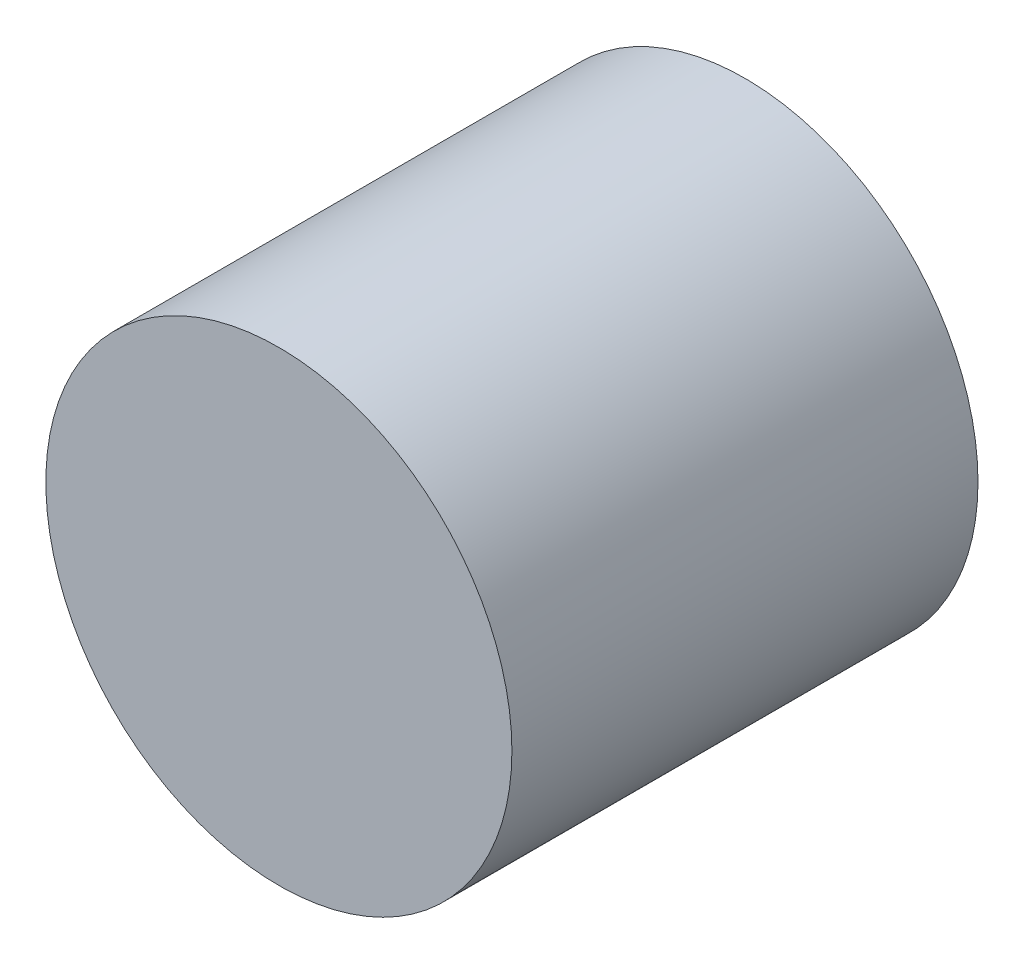
ISO-10303-21;
HEADER;
FILE_DESCRIPTION(('STEP AP214'),'2;1');
FILE_NAME('part.step','',(''),(''),'','','');
FILE_SCHEMA(('AUTOMOTIVE_DESIGN { 1 0 10303 214 1 1 1 1 }'));
ENDSEC;
DATA;
#1=APPLICATION_CONTEXT('core data for automotive mechanical design processes');
#2=APPLICATION_PROTOCOL_DEFINITION('international standard','automotive_design',2000,#1);
#3=PRODUCT_CONTEXT('',#1,'mechanical');
#4=PRODUCT('Part','Part','',(#3));
#5=PRODUCT_RELATED_PRODUCT_CATEGORY('part','',(#4));
#6=PRODUCT_DEFINITION_FORMATION('','',#4);
#7=PRODUCT_DEFINITION_CONTEXT('part definition',#1,'design');
#8=PRODUCT_DEFINITION('design','',#6,#7);
#9=PRODUCT_DEFINITION_SHAPE('','',#8);
#10=(LENGTH_UNIT() NAMED_UNIT(*) SI_UNIT(.MILLI.,.METRE.));
#11=(NAMED_UNIT(*) PLANE_ANGLE_UNIT() SI_UNIT($,.RADIAN.));
#12=(NAMED_UNIT(*) SI_UNIT($,.STERADIAN.) SOLID_ANGLE_UNIT());
#13=UNCERTAINTY_MEASURE_WITH_UNIT(LENGTH_MEASURE(1.E-05),#10,'distance_accuracy_value','');
#14=(GEOMETRIC_REPRESENTATION_CONTEXT(3) GLOBAL_UNCERTAINTY_ASSIGNED_CONTEXT((#13)) GLOBAL_UNIT_ASSIGNED_CONTEXT((#10,
#11,#12)) REPRESENTATION_CONTEXT('',''));
#15=CARTESIAN_POINT('',(0.,0.,0.));
#16=DIRECTION('',(0.,0.,1.));
#17=DIRECTION('',(1.,0.,0.));
#18=AXIS2_PLACEMENT_3D('',#15,#16,#17);
#19=CARTESIAN_POINT('',(-25.5387259839754,9.41740520659094,50.8));
#20=DIRECTION('',(0.,0.,-1.));
#21=DIRECTION('',(-1.,0.,0.));
#22=AXIS2_PLACEMENT_3D('',#19,#20,#21);
#23=CYLINDRICAL_SURFACE('',#22,25.4);
#24=CARTESIAN_POINT('',(-25.5387259839754,9.41740520659094,50.8));
#25=DIRECTION('',(0.,0.,1.));
#26=DIRECTION('',(1.,0.,0.));
#27=AXIS2_PLACEMENT_3D('',#24,#25,#26);
#28=CIRCLE('',#27,25.4);
#29=CARTESIAN_POINT('',(-0.138725983975442,9.41740520659094,50.8));
#30=VERTEX_POINT('',#29);
#31=EDGE_CURVE('E10',#30,#30,#28,.T.);
#32=ORIENTED_EDGE('',*,*,#31,.F.);
#33=EDGE_LOOP('',(#32));
#34=FACE_BOUND('',#33,.T.);
#35=CARTESIAN_POINT('',(-25.5387259839754,9.41740520659094,0.));
#36=DIRECTION('',(0.,0.,1.));
#37=DIRECTION('',(1.,0.,0.));
#38=AXIS2_PLACEMENT_3D('',#35,#36,#37);
#39=CIRCLE('',#38,25.4);
#40=CARTESIAN_POINT('',(-0.138725983975442,9.41740520659094,0.));
#41=VERTEX_POINT('',#40);
#42=EDGE_CURVE('E34',#41,#41,#39,.T.);
#43=ORIENTED_EDGE('',*,*,#42,.T.);
#44=EDGE_LOOP('',(#43));
#45=FACE_BOUND('',#44,.T.);
#46=ADVANCED_FACE('F31',(#34,#45),#23,.T.);
#47=CARTESIAN_POINT('',(-25.5387259839754,9.41740520659094,50.8));
#48=DIRECTION('',(0.,0.,1.));
#49=DIRECTION('',(1.,0.,0.));
#50=AXIS2_PLACEMENT_3D('',#47,#48,#49);
#51=PLANE('',#50);
#52=ORIENTED_EDGE('',*,*,#31,.T.);
#53=EDGE_LOOP('',(#52));
#54=FACE_BOUND('',#53,.T.);
#55=ADVANCED_FACE('F46',(#54),#51,.T.);
#56=CARTESIAN_POINT('',(-25.5387259839754,9.41740520659094,0.));
#57=DIRECTION('',(0.,0.,1.));
#58=DIRECTION('',(1.,0.,0.));
#59=AXIS2_PLACEMENT_3D('',#56,#57,#58);
#60=PLANE('',#59);
#61=ORIENTED_EDGE('',*,*,#42,.F.);
#62=EDGE_LOOP('',(#61));
#63=FACE_BOUND('',#62,.T.);
#64=ADVANCED_FACE('F44',(#63),#60,.F.);
#65=CLOSED_SHELL('',(#46,#55,#64));
#66=MANIFOLD_SOLID_BREP('B2',#65);
#67=ADVANCED_BREP_SHAPE_REPRESENTATION('',(#18,#66),#14);
#68=SHAPE_DEFINITION_REPRESENTATION(#9,#67);
ENDSEC;
END-ISO-10303-21;
